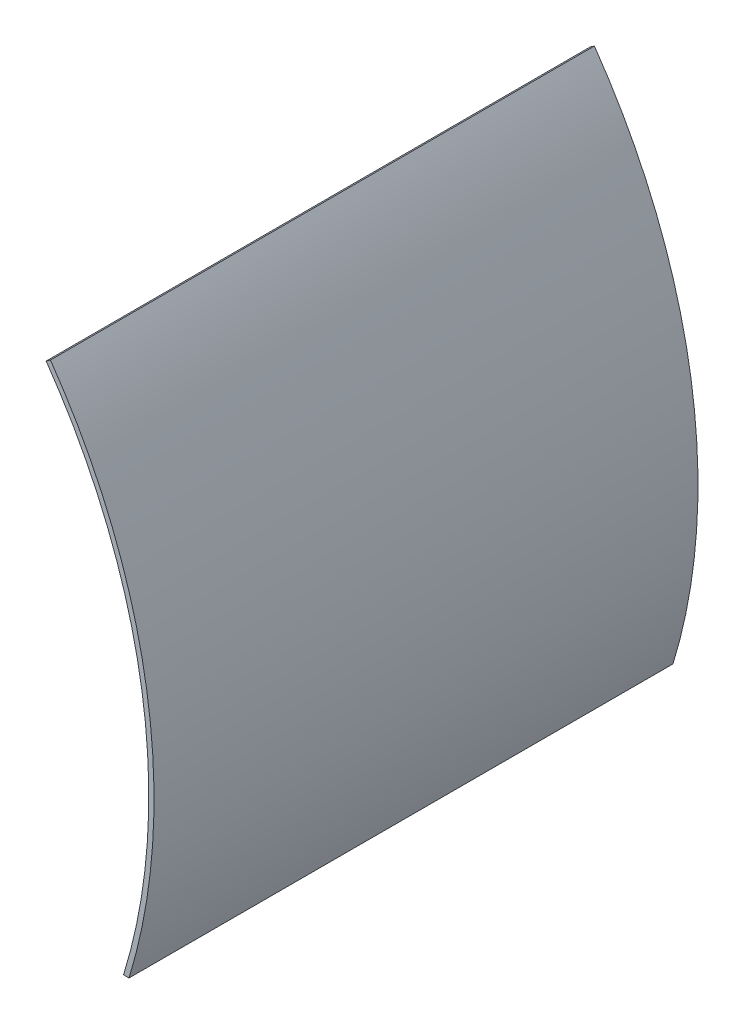
ISO-10303-21;
HEADER;
FILE_DESCRIPTION(('STEP AP214'),'2;1');
FILE_NAME('part.step','',(''),(''),'','','');
FILE_SCHEMA(('AUTOMOTIVE_DESIGN { 1 0 10303 214 1 1 1 1 }'));
ENDSEC;
DATA;
#1=APPLICATION_CONTEXT('core data for automotive mechanical design processes');
#2=APPLICATION_PROTOCOL_DEFINITION('international standard','automotive_design',2000,#1);
#3=PRODUCT_CONTEXT('',#1,'mechanical');
#4=PRODUCT('Part','Part','',(#3));
#5=PRODUCT_RELATED_PRODUCT_CATEGORY('part','',(#4));
#6=PRODUCT_DEFINITION_FORMATION('','',#4);
#7=PRODUCT_DEFINITION_CONTEXT('part definition',#1,'design');
#8=PRODUCT_DEFINITION('design','',#6,#7);
#9=PRODUCT_DEFINITION_SHAPE('','',#8);
#10=(LENGTH_UNIT() NAMED_UNIT(*) SI_UNIT(.MILLI.,.METRE.));
#11=(NAMED_UNIT(*) PLANE_ANGLE_UNIT() SI_UNIT($,.RADIAN.));
#12=(NAMED_UNIT(*) SI_UNIT($,.STERADIAN.) SOLID_ANGLE_UNIT());
#13=UNCERTAINTY_MEASURE_WITH_UNIT(LENGTH_MEASURE(1.E-05),#10,'distance_accuracy_value','');
#14=(GEOMETRIC_REPRESENTATION_CONTEXT(3) GLOBAL_UNCERTAINTY_ASSIGNED_CONTEXT((#13)) GLOBAL_UNIT_ASSIGNED_CONTEXT((#10,
#11,#12)) REPRESENTATION_CONTEXT('',''));
#15=CARTESIAN_POINT('',(0.,0.,0.));
#16=DIRECTION('',(0.,0.,1.));
#17=DIRECTION('',(1.,0.,0.));
#18=AXIS2_PLACEMENT_3D('',#15,#16,#17);
#19=CARTESIAN_POINT('',(166.242784735346,-50.8,165.1));
#20=DIRECTION('',(0.,1.,0.));
#21=DIRECTION('',(-1.,0.,0.));
#22=AXIS2_PLACEMENT_3D('',#19,#20,#21);
#23=PLANE('',#22);
#24=DIRECTION('',(1.,0.,0.));
#25=VECTOR('',#24,1.);
#26=CARTESIAN_POINT('',(166.242784735346,-50.8,0.));
#27=LINE('',#26,#25);
#28=CARTESIAN_POINT('',(164.582105388352,-50.8,0.));
#29=VERTEX_POINT('',#28);
#30=CARTESIAN_POINT('',(166.242784735346,-50.8,0.));
#31=VERTEX_POINT('',#30);
#32=EDGE_CURVE('E87',#29,#31,#27,.T.);
#33=ORIENTED_EDGE('',*,*,#32,.T.);
#34=DIRECTION('',(0.,0.,-1.));
#35=VECTOR('',#34,1.);
#36=CARTESIAN_POINT('',(166.242784735346,-50.8,165.1));
#37=LINE('',#36,#35);
#38=CARTESIAN_POINT('',(166.242784735346,-50.8,165.1));
#39=VERTEX_POINT('',#38);
#40=EDGE_CURVE('E41',#39,#31,#37,.T.);
#41=ORIENTED_EDGE('',*,*,#40,.F.);
#42=DIRECTION('',(1.,0.,0.));
#43=VECTOR('',#42,1.);
#44=CARTESIAN_POINT('',(166.242784735346,-50.8,165.1));
#45=LINE('',#44,#43);
#46=CARTESIAN_POINT('',(164.582105388352,-50.8,165.1));
#47=VERTEX_POINT('',#46);
#48=EDGE_CURVE('E79',#47,#39,#45,.T.);
#49=ORIENTED_EDGE('',*,*,#48,.F.);
#50=DIRECTION('',(0.,0.,-1.));
#51=VECTOR('',#50,1.);
#52=CARTESIAN_POINT('',(164.582105388352,-50.8,165.1));
#53=LINE('',#52,#51);
#54=EDGE_CURVE('E11',#47,#29,#53,.T.);
#55=ORIENTED_EDGE('',*,*,#54,.T.);
#56=EDGE_LOOP('',(#33,#41,#49,#55));
#57=FACE_BOUND('',#56,.T.);
#58=ADVANCED_FACE('F33',(#57),#23,.F.);
#59=CARTESIAN_POINT('',(0.,0.,165.1));
#60=DIRECTION('',(0.,0.,-1.));
#61=DIRECTION('',(-1.,0.,0.));
#62=AXIS2_PLACEMENT_3D('',#59,#60,#61);
#63=CYLINDRICAL_SURFACE('',#62,173.83125);
#64=CARTESIAN_POINT('',(0.,0.,0.));
#65=DIRECTION('',(0.,0.,1.));
#66=DIRECTION('',(1.,0.,0.));
#67=AXIS2_PLACEMENT_3D('',#64,#65,#66);
#68=CIRCLE('',#67,173.83125);
#69=CARTESIAN_POINT('',(142.394223798811,99.7055089014479,0.));
#70=VERTEX_POINT('',#69);
#71=EDGE_CURVE('E66',#31,#70,#68,.T.);
#72=ORIENTED_EDGE('',*,*,#71,.T.);
#73=DIRECTION('',(0.,0.,-1.));
#74=VECTOR('',#73,1.);
#75=CARTESIAN_POINT('',(142.394223798811,99.7055089014479,165.1));
#76=LINE('',#75,#74);
#77=CARTESIAN_POINT('',(142.394223798811,99.7055089014479,165.1));
#78=VERTEX_POINT('',#77);
#79=EDGE_CURVE('E88',#78,#70,#76,.T.);
#80=ORIENTED_EDGE('',*,*,#79,.F.);
#81=CARTESIAN_POINT('',(0.,0.,165.1));
#82=DIRECTION('',(0.,0.,1.));
#83=DIRECTION('',(-1.,0.,0.));
#84=AXIS2_PLACEMENT_3D('',#81,#82,#83);
#85=CIRCLE('',#84,173.83125);
#86=EDGE_CURVE('E83',#39,#78,#85,.T.);
#87=ORIENTED_EDGE('',*,*,#86,.F.);
#88=ORIENTED_EDGE('',*,*,#40,.T.);
#89=EDGE_LOOP('',(#72,#80,#87,#88));
#90=FACE_BOUND('',#89,.T.);
#91=ADVANCED_FACE('F89',(#90),#63,.T.);
#92=CARTESIAN_POINT('',(141.093819928502,98.7949563087407,165.1));
#93=DIRECTION('',(0.573576436351046,-0.819152044288992,0.));
#94=DIRECTION('',(0.819152044288992,0.573576436351046,0.));
#95=AXIS2_PLACEMENT_3D('',#92,#93,#94);
#96=PLANE('',#95);
#97=DIRECTION('',(-0.819152044288992,-0.573576436351046,0.));
#98=VECTOR('',#97,1.);
#99=CARTESIAN_POINT('',(141.093819928502,98.7949563087407,0.));
#100=LINE('',#99,#98);
#101=CARTESIAN_POINT('',(141.093819928502,98.7949563087407,0.));
#102=VERTEX_POINT('',#101);
#103=EDGE_CURVE('E73',#70,#102,#100,.T.);
#104=ORIENTED_EDGE('',*,*,#103,.T.);
#105=DIRECTION('',(0.,0.,-1.));
#106=VECTOR('',#105,1.);
#107=CARTESIAN_POINT('',(141.093819928502,98.7949563087407,165.1));
#108=LINE('',#107,#106);
#109=CARTESIAN_POINT('',(141.093819928502,98.7949563087407,165.1));
#110=VERTEX_POINT('',#109);
#111=EDGE_CURVE('E93',#110,#102,#108,.T.);
#112=ORIENTED_EDGE('',*,*,#111,.F.);
#113=DIRECTION('',(-0.819152044288992,-0.573576436351046,0.));
#114=VECTOR('',#113,1.);
#115=CARTESIAN_POINT('',(141.093819928502,98.7949563087407,165.1));
#116=LINE('',#115,#114);
#117=EDGE_CURVE('E91',#78,#110,#116,.T.);
#118=ORIENTED_EDGE('',*,*,#117,.F.);
#119=ORIENTED_EDGE('',*,*,#79,.T.);
#120=EDGE_LOOP('',(#104,#112,#118,#119));
#121=FACE_BOUND('',#120,.T.);
#122=ADVANCED_FACE('F103',(#121),#96,.F.);
#123=CARTESIAN_POINT('',(0.,0.,165.1));
#124=DIRECTION('',(0.,0.,-1.));
#125=DIRECTION('',(-1.,0.,0.));
#126=AXIS2_PLACEMENT_3D('',#123,#124,#125);
#127=CYLINDRICAL_SURFACE('',#126,172.24375);
#128=CARTESIAN_POINT('',(0.,0.,0.));
#129=DIRECTION('',(0.,0.,-1.));
#130=DIRECTION('',(1.,0.,0.));
#131=AXIS2_PLACEMENT_3D('',#128,#129,#130);
#132=CIRCLE('',#131,172.24375);
#133=EDGE_CURVE('E100',#102,#29,#132,.T.);
#134=ORIENTED_EDGE('',*,*,#133,.T.);
#135=ORIENTED_EDGE('',*,*,#54,.F.);
#136=CARTESIAN_POINT('',(0.,0.,165.1));
#137=DIRECTION('',(0.,0.,-1.));
#138=DIRECTION('',(-1.,0.,0.));
#139=AXIS2_PLACEMENT_3D('',#136,#137,#138);
#140=CIRCLE('',#139,172.24375);
#141=EDGE_CURVE('E49',#110,#47,#140,.T.);
#142=ORIENTED_EDGE('',*,*,#141,.F.);
#143=ORIENTED_EDGE('',*,*,#111,.T.);
#144=EDGE_LOOP('',(#134,#135,#142,#143));
#145=FACE_BOUND('',#144,.T.);
#146=ADVANCED_FACE('F107',(#145),#127,.F.);
#147=CARTESIAN_POINT('',(0.,0.,165.1));
#148=DIRECTION('',(0.,0.,-1.));
#149=DIRECTION('',(-1.,0.,0.));
#150=AXIS2_PLACEMENT_3D('',#147,#148,#149);
#151=PLANE('',#150);
#152=ORIENTED_EDGE('',*,*,#141,.T.);
#153=ORIENTED_EDGE('',*,*,#48,.T.);
#154=ORIENTED_EDGE('',*,*,#86,.T.);
#155=ORIENTED_EDGE('',*,*,#117,.T.);
#156=EDGE_LOOP('',(#152,#153,#154,#155));
#157=FACE_BOUND('',#156,.T.);
#158=ADVANCED_FACE('F81',(#157),#151,.F.);
#159=CARTESIAN_POINT('',(0.,0.,0.));
#160=DIRECTION('',(0.,0.,-1.));
#161=DIRECTION('',(-1.,0.,0.));
#162=AXIS2_PLACEMENT_3D('',#159,#160,#161);
#163=PLANE('',#162);
#164=ORIENTED_EDGE('',*,*,#32,.F.);
#165=ORIENTED_EDGE('',*,*,#133,.F.);
#166=ORIENTED_EDGE('',*,*,#103,.F.);
#167=ORIENTED_EDGE('',*,*,#71,.F.);
#168=EDGE_LOOP('',(#164,#165,#166,#167));
#169=FACE_BOUND('',#168,.T.);
#170=ADVANCED_FACE('F106',(#169),#163,.T.);
#171=CLOSED_SHELL('',(#58,#91,#122,#146,#158,#170));
#172=MANIFOLD_SOLID_BREP('B2',#171);
#173=ADVANCED_BREP_SHAPE_REPRESENTATION('',(#18,#172),#14);
#174=SHAPE_DEFINITION_REPRESENTATION(#9,#173);
ENDSEC;
END-ISO-10303-21;
